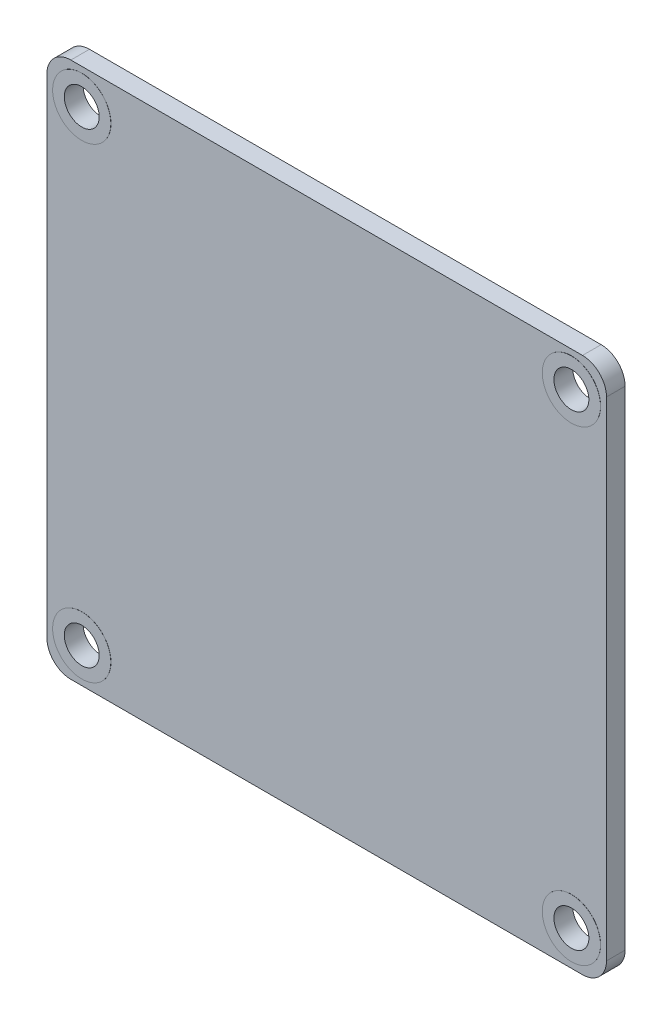
ISO-10303-21;
HEADER;
FILE_DESCRIPTION(('STEP AP214'),'2;1');
FILE_NAME('part.step','',(''),(''),'','','');
FILE_SCHEMA(('AUTOMOTIVE_DESIGN { 1 0 10303 214 1 1 1 1 }'));
ENDSEC;
DATA;
#1=APPLICATION_CONTEXT('core data for automotive mechanical design processes');
#2=APPLICATION_PROTOCOL_DEFINITION('international standard','automotive_design',2000,#1);
#3=PRODUCT_CONTEXT('',#1,'mechanical');
#4=PRODUCT('Part','Part','',(#3));
#5=PRODUCT_RELATED_PRODUCT_CATEGORY('part','',(#4));
#6=PRODUCT_DEFINITION_FORMATION('','',#4);
#7=PRODUCT_DEFINITION_CONTEXT('part definition',#1,'design');
#8=PRODUCT_DEFINITION('design','',#6,#7);
#9=PRODUCT_DEFINITION_SHAPE('','',#8);
#10=(LENGTH_UNIT() NAMED_UNIT(*) SI_UNIT(.MILLI.,.METRE.));
#11=(NAMED_UNIT(*) PLANE_ANGLE_UNIT() SI_UNIT($,.RADIAN.));
#12=(NAMED_UNIT(*) SI_UNIT($,.STERADIAN.) SOLID_ANGLE_UNIT());
#13=UNCERTAINTY_MEASURE_WITH_UNIT(LENGTH_MEASURE(1.E-05),#10,'distance_accuracy_value','');
#14=(GEOMETRIC_REPRESENTATION_CONTEXT(3) GLOBAL_UNCERTAINTY_ASSIGNED_CONTEXT((#13)) GLOBAL_UNIT_ASSIGNED_CONTEXT((#10,
#11,#12)) REPRESENTATION_CONTEXT('',''));
#15=CARTESIAN_POINT('',(0.,0.,0.));
#16=DIRECTION('',(0.,0.,1.));
#17=DIRECTION('',(1.,0.,0.));
#18=AXIS2_PLACEMENT_3D('',#15,#16,#17);
#19=CARTESIAN_POINT('',(146.604450980759,99.3487028032038,-0.01));
#20=DIRECTION('',(0.,0.,1.));
#21=DIRECTION('',(1.,0.,0.));
#22=AXIS2_PLACEMENT_3D('',#19,#20,#21);
#23=CYLINDRICAL_SURFACE('',#22,2.5);
#24=CARTESIAN_POINT('',(146.604450980759,99.3487028032038,-0.01));
#25=DIRECTION('',(0.,0.,1.));
#26=DIRECTION('',(1.,0.,0.));
#27=AXIS2_PLACEMENT_3D('',#24,#25,#26);
#28=CIRCLE('',#27,2.5);
#29=CARTESIAN_POINT('',(149.104450980759,99.3487028032038,-0.01));
#30=VERTEX_POINT('',#29);
#31=EDGE_CURVE('E11',#30,#30,#28,.T.);
#32=ORIENTED_EDGE('',*,*,#31,.T.);
#33=EDGE_LOOP('',(#32));
#34=FACE_BOUND('',#33,.T.);
#35=CARTESIAN_POINT('',(146.604450980759,99.3487028032038,1.61));
#36=DIRECTION('',(0.,0.,1.));
#37=DIRECTION('',(1.,0.,0.));
#38=AXIS2_PLACEMENT_3D('',#35,#36,#37);
#39=CIRCLE('',#38,2.5);
#40=CARTESIAN_POINT('',(149.104450980759,99.3487028032038,1.61));
#41=VERTEX_POINT('',#40);
#42=EDGE_CURVE('E50',#41,#41,#39,.T.);
#43=ORIENTED_EDGE('',*,*,#42,.F.);
#44=EDGE_LOOP('',(#43));
#45=FACE_BOUND('',#44,.T.);
#46=ADVANCED_FACE('F40',(#34,#45),#23,.T.);
#47=CARTESIAN_POINT('',(146.604450980759,99.3487028032038,-0.01));
#48=DIRECTION('',(0.,0.,1.));
#49=DIRECTION('',(1.,0.,0.));
#50=AXIS2_PLACEMENT_3D('',#47,#48,#49);
#51=PLANE('',#50);
#52=CARTESIAN_POINT('',(146.604450980759,99.3487028032038,-0.01));
#53=DIRECTION('',(0.,0.,1.));
#54=DIRECTION('',(1.,0.,0.));
#55=AXIS2_PLACEMENT_3D('',#52,#53,#54);
#56=CIRCLE('',#55,1.5);
#57=CARTESIAN_POINT('',(148.104450980759,99.3487028032038,-0.01));
#58=VERTEX_POINT('',#57);
#59=EDGE_CURVE('E46',#58,#58,#56,.T.);
#60=ORIENTED_EDGE('',*,*,#59,.T.);
#61=EDGE_LOOP('',(#60));
#62=FACE_BOUND('',#61,.T.);
#63=ORIENTED_EDGE('',*,*,#31,.F.);
#64=EDGE_LOOP('',(#63));
#65=FACE_BOUND('',#64,.T.);
#66=ADVANCED_FACE('F69',(#62,#65),#51,.F.);
#67=CARTESIAN_POINT('',(146.604450980759,99.3487028032038,-0.01));
#68=DIRECTION('',(0.,0.,1.));
#69=DIRECTION('',(1.,0.,0.));
#70=AXIS2_PLACEMENT_3D('',#67,#68,#69);
#71=CYLINDRICAL_SURFACE('',#70,1.5);
#72=ORIENTED_EDGE('',*,*,#59,.F.);
#73=EDGE_LOOP('',(#72));
#74=FACE_BOUND('',#73,.T.);
#75=CARTESIAN_POINT('',(146.604450980759,99.3487028032038,1.61));
#76=DIRECTION('',(0.,0.,1.));
#77=DIRECTION('',(1.,0.,0.));
#78=AXIS2_PLACEMENT_3D('',#75,#76,#77);
#79=CIRCLE('',#78,1.5);
#80=CARTESIAN_POINT('',(148.104450980759,99.3487028032038,1.61));
#81=VERTEX_POINT('',#80);
#82=EDGE_CURVE('E54',#81,#81,#79,.T.);
#83=ORIENTED_EDGE('',*,*,#82,.T.);
#84=EDGE_LOOP('',(#83));
#85=FACE_BOUND('',#84,.T.);
#86=ADVANCED_FACE('F60',(#74,#85),#71,.F.);
#87=CARTESIAN_POINT('',(146.604450980759,99.3487028032038,1.61));
#88=DIRECTION('',(0.,0.,1.));
#89=DIRECTION('',(1.,0.,0.));
#90=AXIS2_PLACEMENT_3D('',#87,#88,#89);
#91=PLANE('',#90);
#92=ORIENTED_EDGE('',*,*,#42,.T.);
#93=EDGE_LOOP('',(#92));
#94=FACE_BOUND('',#93,.T.);
#95=ORIENTED_EDGE('',*,*,#82,.F.);
#96=EDGE_LOOP('',(#95));
#97=FACE_BOUND('',#96,.T.);
#98=ADVANCED_FACE('F62',(#94,#97),#91,.T.);
#99=CLOSED_SHELL('',(#46,#66,#86,#98));
#100=MANIFOLD_SOLID_BREP('B2',#99);
#101=CARTESIAN_POINT('',(104.569478388759,99.3487028032038,-0.01));
#102=DIRECTION('',(0.,0.,1.));
#103=DIRECTION('',(1.,0.,0.));
#104=AXIS2_PLACEMENT_3D('',#101,#102,#103);
#105=CYLINDRICAL_SURFACE('',#104,2.5);
#106=CARTESIAN_POINT('',(104.569478388759,99.3487028032038,-0.01));
#107=DIRECTION('',(0.,0.,1.));
#108=DIRECTION('',(1.,0.,0.));
#109=AXIS2_PLACEMENT_3D('',#106,#107,#108);
#110=CIRCLE('',#109,2.5);
#111=CARTESIAN_POINT('',(107.069478388759,99.3487028032038,-0.01));
#112=VERTEX_POINT('',#111);
#113=EDGE_CURVE('E39',#112,#112,#110,.T.);
#114=ORIENTED_EDGE('',*,*,#113,.T.);
#115=EDGE_LOOP('',(#114));
#116=FACE_BOUND('',#115,.T.);
#117=CARTESIAN_POINT('',(104.569478388759,99.3487028032038,1.61));
#118=DIRECTION('',(0.,0.,1.));
#119=DIRECTION('',(1.,0.,0.));
#120=AXIS2_PLACEMENT_3D('',#117,#118,#119);
#121=CIRCLE('',#120,2.5);
#122=CARTESIAN_POINT('',(107.069478388759,99.3487028032038,1.61));
#123=VERTEX_POINT('',#122);
#124=EDGE_CURVE('E120',#123,#123,#121,.T.);
#125=ORIENTED_EDGE('',*,*,#124,.F.);
#126=EDGE_LOOP('',(#125));
#127=FACE_BOUND('',#126,.T.);
#128=ADVANCED_FACE('F110',(#116,#127),#105,.T.);
#129=CARTESIAN_POINT('',(104.569478388759,99.3487028032038,-0.01));
#130=DIRECTION('',(0.,0.,1.));
#131=DIRECTION('',(1.,0.,0.));
#132=AXIS2_PLACEMENT_3D('',#129,#130,#131);
#133=PLANE('',#132);
#134=CARTESIAN_POINT('',(104.569478388759,99.3487028032038,-0.01));
#135=DIRECTION('',(0.,0.,1.));
#136=DIRECTION('',(1.,0.,0.));
#137=AXIS2_PLACEMENT_3D('',#134,#135,#136);
#138=CIRCLE('',#137,1.5);
#139=CARTESIAN_POINT('',(106.069478388759,99.3487028032038,-0.01));
#140=VERTEX_POINT('',#139);
#141=EDGE_CURVE('E116',#140,#140,#138,.T.);
#142=ORIENTED_EDGE('',*,*,#141,.T.);
#143=EDGE_LOOP('',(#142));
#144=FACE_BOUND('',#143,.T.);
#145=ORIENTED_EDGE('',*,*,#113,.F.);
#146=EDGE_LOOP('',(#145));
#147=FACE_BOUND('',#146,.T.);
#148=ADVANCED_FACE('F139',(#144,#147),#133,.F.);
#149=CARTESIAN_POINT('',(104.569478388759,99.3487028032038,-0.01));
#150=DIRECTION('',(0.,0.,1.));
#151=DIRECTION('',(1.,0.,0.));
#152=AXIS2_PLACEMENT_3D('',#149,#150,#151);
#153=CYLINDRICAL_SURFACE('',#152,1.5);
#154=ORIENTED_EDGE('',*,*,#141,.F.);
#155=EDGE_LOOP('',(#154));
#156=FACE_BOUND('',#155,.T.);
#157=CARTESIAN_POINT('',(104.569478388759,99.3487028032038,1.61));
#158=DIRECTION('',(0.,0.,1.));
#159=DIRECTION('',(1.,0.,0.));
#160=AXIS2_PLACEMENT_3D('',#157,#158,#159);
#161=CIRCLE('',#160,1.5);
#162=CARTESIAN_POINT('',(106.069478388759,99.3487028032038,1.61));
#163=VERTEX_POINT('',#162);
#164=EDGE_CURVE('E124',#163,#163,#161,.T.);
#165=ORIENTED_EDGE('',*,*,#164,.T.);
#166=EDGE_LOOP('',(#165));
#167=FACE_BOUND('',#166,.T.);
#168=ADVANCED_FACE('F130',(#156,#167),#153,.F.);
#169=CARTESIAN_POINT('',(104.569478388759,99.3487028032038,1.61));
#170=DIRECTION('',(0.,0.,1.));
#171=DIRECTION('',(1.,0.,0.));
#172=AXIS2_PLACEMENT_3D('',#169,#170,#171);
#173=PLANE('',#172);
#174=ORIENTED_EDGE('',*,*,#124,.T.);
#175=EDGE_LOOP('',(#174));
#176=FACE_BOUND('',#175,.T.);
#177=ORIENTED_EDGE('',*,*,#164,.F.);
#178=EDGE_LOOP('',(#177));
#179=FACE_BOUND('',#178,.T.);
#180=ADVANCED_FACE('F132',(#176,#179),#173,.T.);
#181=CLOSED_SHELL('',(#128,#148,#168,#180));
#182=MANIFOLD_SOLID_BREP('B6',#181);
#183=CARTESIAN_POINT('',(104.569478388759,139.38728612082,-0.01));
#184=DIRECTION('',(0.,0.,1.));
#185=DIRECTION('',(1.,0.,0.));
#186=AXIS2_PLACEMENT_3D('',#183,#184,#185);
#187=CYLINDRICAL_SURFACE('',#186,2.5);
#188=CARTESIAN_POINT('',(104.569478388759,139.38728612082,-0.01));
#189=DIRECTION('',(0.,0.,1.));
#190=DIRECTION('',(1.,0.,0.));
#191=AXIS2_PLACEMENT_3D('',#188,#189,#190);
#192=CIRCLE('',#191,2.5);
#193=CARTESIAN_POINT('',(107.069478388759,139.38728612082,-0.01));
#194=VERTEX_POINT('',#193);
#195=EDGE_CURVE('E109',#194,#194,#192,.T.);
#196=ORIENTED_EDGE('',*,*,#195,.T.);
#197=EDGE_LOOP('',(#196));
#198=FACE_BOUND('',#197,.T.);
#199=CARTESIAN_POINT('',(104.569478388759,139.38728612082,1.61));
#200=DIRECTION('',(0.,0.,1.));
#201=DIRECTION('',(1.,0.,0.));
#202=AXIS2_PLACEMENT_3D('',#199,#200,#201);
#203=CIRCLE('',#202,2.5);
#204=CARTESIAN_POINT('',(107.069478388759,139.38728612082,1.61));
#205=VERTEX_POINT('',#204);
#206=EDGE_CURVE('E190',#205,#205,#203,.T.);
#207=ORIENTED_EDGE('',*,*,#206,.F.);
#208=EDGE_LOOP('',(#207));
#209=FACE_BOUND('',#208,.T.);
#210=ADVANCED_FACE('F180',(#198,#209),#187,.T.);
#211=CARTESIAN_POINT('',(104.569478388759,139.38728612082,-0.01));
#212=DIRECTION('',(0.,0.,1.));
#213=DIRECTION('',(1.,0.,0.));
#214=AXIS2_PLACEMENT_3D('',#211,#212,#213);
#215=PLANE('',#214);
#216=CARTESIAN_POINT('',(104.569478388759,139.38728612082,-0.01));
#217=DIRECTION('',(0.,0.,1.));
#218=DIRECTION('',(1.,0.,0.));
#219=AXIS2_PLACEMENT_3D('',#216,#217,#218);
#220=CIRCLE('',#219,1.5);
#221=CARTESIAN_POINT('',(106.069478388759,139.38728612082,-0.01));
#222=VERTEX_POINT('',#221);
#223=EDGE_CURVE('E186',#222,#222,#220,.T.);
#224=ORIENTED_EDGE('',*,*,#223,.T.);
#225=EDGE_LOOP('',(#224));
#226=FACE_BOUND('',#225,.T.);
#227=ORIENTED_EDGE('',*,*,#195,.F.);
#228=EDGE_LOOP('',(#227));
#229=FACE_BOUND('',#228,.T.);
#230=ADVANCED_FACE('F209',(#226,#229),#215,.F.);
#231=CARTESIAN_POINT('',(104.569478388759,139.38728612082,-0.01));
#232=DIRECTION('',(0.,0.,1.));
#233=DIRECTION('',(1.,0.,0.));
#234=AXIS2_PLACEMENT_3D('',#231,#232,#233);
#235=CYLINDRICAL_SURFACE('',#234,1.5);
#236=ORIENTED_EDGE('',*,*,#223,.F.);
#237=EDGE_LOOP('',(#236));
#238=FACE_BOUND('',#237,.T.);
#239=CARTESIAN_POINT('',(104.569478388759,139.38728612082,1.61));
#240=DIRECTION('',(0.,0.,1.));
#241=DIRECTION('',(1.,0.,0.));
#242=AXIS2_PLACEMENT_3D('',#239,#240,#241);
#243=CIRCLE('',#242,1.5);
#244=CARTESIAN_POINT('',(106.069478388759,139.38728612082,1.61));
#245=VERTEX_POINT('',#244);
#246=EDGE_CURVE('E194',#245,#245,#243,.T.);
#247=ORIENTED_EDGE('',*,*,#246,.T.);
#248=EDGE_LOOP('',(#247));
#249=FACE_BOUND('',#248,.T.);
#250=ADVANCED_FACE('F200',(#238,#249),#235,.F.);
#251=CARTESIAN_POINT('',(104.569478388759,139.38728612082,1.61));
#252=DIRECTION('',(0.,0.,1.));
#253=DIRECTION('',(1.,0.,0.));
#254=AXIS2_PLACEMENT_3D('',#251,#252,#253);
#255=PLANE('',#254);
#256=ORIENTED_EDGE('',*,*,#206,.T.);
#257=EDGE_LOOP('',(#256));
#258=FACE_BOUND('',#257,.T.);
#259=ORIENTED_EDGE('',*,*,#246,.F.);
#260=EDGE_LOOP('',(#259));
#261=FACE_BOUND('',#260,.T.);
#262=ADVANCED_FACE('F202',(#258,#261),#255,.T.);
#263=CLOSED_SHELL('',(#210,#230,#250,#262));
#264=MANIFOLD_SOLID_BREP('B34',#263);
#265=CARTESIAN_POINT('',(146.604450980759,139.38728612082,-0.01));
#266=DIRECTION('',(0.,0.,1.));
#267=DIRECTION('',(1.,0.,0.));
#268=AXIS2_PLACEMENT_3D('',#265,#266,#267);
#269=CYLINDRICAL_SURFACE('',#268,2.5);
#270=CARTESIAN_POINT('',(146.604450980759,139.38728612082,-0.01));
#271=DIRECTION('',(0.,0.,1.));
#272=DIRECTION('',(1.,0.,0.));
#273=AXIS2_PLACEMENT_3D('',#270,#271,#272);
#274=CIRCLE('',#273,2.5);
#275=CARTESIAN_POINT('',(149.104450980759,139.38728612082,-0.01));
#276=VERTEX_POINT('',#275);
#277=EDGE_CURVE('E179',#276,#276,#274,.T.);
#278=ORIENTED_EDGE('',*,*,#277,.T.);
#279=EDGE_LOOP('',(#278));
#280=FACE_BOUND('',#279,.T.);
#281=CARTESIAN_POINT('',(146.604450980759,139.38728612082,1.61));
#282=DIRECTION('',(0.,0.,1.));
#283=DIRECTION('',(1.,0.,0.));
#284=AXIS2_PLACEMENT_3D('',#281,#282,#283);
#285=CIRCLE('',#284,2.5);
#286=CARTESIAN_POINT('',(149.104450980759,139.38728612082,1.61));
#287=VERTEX_POINT('',#286);
#288=EDGE_CURVE('E261',#287,#287,#285,.T.);
#289=ORIENTED_EDGE('',*,*,#288,.F.);
#290=EDGE_LOOP('',(#289));
#291=FACE_BOUND('',#290,.T.);
#292=ADVANCED_FACE('F251',(#280,#291),#269,.T.);
#293=CARTESIAN_POINT('',(146.604450980759,139.38728612082,-0.01));
#294=DIRECTION('',(0.,0.,1.));
#295=DIRECTION('',(1.,0.,0.));
#296=AXIS2_PLACEMENT_3D('',#293,#294,#295);
#297=PLANE('',#296);
#298=CARTESIAN_POINT('',(146.604450980759,139.38728612082,-0.01));
#299=DIRECTION('',(0.,0.,1.));
#300=DIRECTION('',(1.,0.,0.));
#301=AXIS2_PLACEMENT_3D('',#298,#299,#300);
#302=CIRCLE('',#301,1.5);
#303=CARTESIAN_POINT('',(148.104450980759,139.38728612082,-0.01));
#304=VERTEX_POINT('',#303);
#305=EDGE_CURVE('E257',#304,#304,#302,.T.);
#306=ORIENTED_EDGE('',*,*,#305,.T.);
#307=EDGE_LOOP('',(#306));
#308=FACE_BOUND('',#307,.T.);
#309=ORIENTED_EDGE('',*,*,#277,.F.);
#310=EDGE_LOOP('',(#309));
#311=FACE_BOUND('',#310,.T.);
#312=ADVANCED_FACE('F280',(#308,#311),#297,.F.);
#313=CARTESIAN_POINT('',(146.604450980759,139.38728612082,-0.01));
#314=DIRECTION('',(0.,0.,1.));
#315=DIRECTION('',(1.,0.,0.));
#316=AXIS2_PLACEMENT_3D('',#313,#314,#315);
#317=CYLINDRICAL_SURFACE('',#316,1.5);
#318=ORIENTED_EDGE('',*,*,#305,.F.);
#319=EDGE_LOOP('',(#318));
#320=FACE_BOUND('',#319,.T.);
#321=CARTESIAN_POINT('',(146.604450980759,139.38728612082,1.61));
#322=DIRECTION('',(0.,0.,1.));
#323=DIRECTION('',(1.,0.,0.));
#324=AXIS2_PLACEMENT_3D('',#321,#322,#323);
#325=CIRCLE('',#324,1.5);
#326=CARTESIAN_POINT('',(148.104450980759,139.38728612082,1.61));
#327=VERTEX_POINT('',#326);
#328=EDGE_CURVE('E265',#327,#327,#325,.T.);
#329=ORIENTED_EDGE('',*,*,#328,.T.);
#330=EDGE_LOOP('',(#329));
#331=FACE_BOUND('',#330,.T.);
#332=ADVANCED_FACE('F271',(#320,#331),#317,.F.);
#333=CARTESIAN_POINT('',(146.604450980759,139.38728612082,1.61));
#334=DIRECTION('',(0.,0.,1.));
#335=DIRECTION('',(1.,0.,0.));
#336=AXIS2_PLACEMENT_3D('',#333,#334,#335);
#337=PLANE('',#336);
#338=ORIENTED_EDGE('',*,*,#288,.T.);
#339=EDGE_LOOP('',(#338));
#340=FACE_BOUND('',#339,.T.);
#341=ORIENTED_EDGE('',*,*,#328,.F.);
#342=EDGE_LOOP('',(#341));
#343=FACE_BOUND('',#342,.T.);
#344=ADVANCED_FACE('F273',(#340,#343),#337,.T.);
#345=CLOSED_SHELL('',(#292,#312,#332,#344));
#346=MANIFOLD_SOLID_BREP('B104',#345);
#347=CARTESIAN_POINT('',(103.626682713888,140.330081795691,1.6));
#348=DIRECTION('',(0.,0.,-1.));
#349=DIRECTION('',(-1.,0.,0.));
#350=AXIS2_PLACEMENT_3D('',#347,#348,#349);
#351=PLANE('',#350);
#352=CARTESIAN_POINT('',(103.626682713888,140.330081795691,1.6));
#353=DIRECTION('',(0.,0.,1.));
#354=DIRECTION('',(-1.,0.,0.));
#355=AXIS2_PLACEMENT_3D('',#352,#353,#354);
#356=CIRCLE('',#355,2.05977480797048);
#357=CARTESIAN_POINT('',(103.626682713888,142.389856603662,1.6));
#358=VERTEX_POINT('',#357);
#359=CARTESIAN_POINT('',(101.566907905917,140.330081795691,1.6));
#360=VERTEX_POINT('',#359);
#361=EDGE_CURVE('E425',#358,#360,#356,.T.);
#362=ORIENTED_EDGE('',*,*,#361,.T.);
#363=DIRECTION('',(0.,-1.,0.));
#364=VECTOR('',#363,1.);
#365=CARTESIAN_POINT('',(101.566907905917,140.330081795691,1.6));
#366=LINE('',#365,#364);
#367=CARTESIAN_POINT('',(101.566907905917,98.4059071283329,1.6));
#368=VERTEX_POINT('',#367);
#369=EDGE_CURVE('E373',#360,#368,#366,.T.);
#370=ORIENTED_EDGE('',*,*,#369,.T.);
#371=CARTESIAN_POINT('',(103.626682713888,98.4059071283329,1.6));
#372=DIRECTION('',(0.,0.,1.));
#373=DIRECTION('',(-1.,0.,0.));
#374=AXIS2_PLACEMENT_3D('',#371,#372,#373);
#375=CIRCLE('',#374,2.05977480797049);
#376=CARTESIAN_POINT('',(103.626682713888,96.3461323203624,1.6));
#377=VERTEX_POINT('',#376);
#378=EDGE_CURVE('E440',#368,#377,#375,.T.);
#379=ORIENTED_EDGE('',*,*,#378,.T.);
#380=DIRECTION('',(1.,0.,0.));
#381=VECTOR('',#380,1.);
#382=CARTESIAN_POINT('',(103.626682713888,96.3461323203624,1.6));
#383=LINE('',#382,#381);
#384=CARTESIAN_POINT('',(147.547246655631,96.3461323203624,1.6));
#385=VERTEX_POINT('',#384);
#386=EDGE_CURVE('E453',#377,#385,#383,.T.);
#387=ORIENTED_EDGE('',*,*,#386,.T.);
#388=CARTESIAN_POINT('',(147.547246655631,98.4059071283329,1.6));
#389=DIRECTION('',(0.,0.,1.));
#390=DIRECTION('',(-1.,0.,0.));
#391=AXIS2_PLACEMENT_3D('',#388,#389,#390);
#392=CIRCLE('',#391,2.05977480797048);
#393=CARTESIAN_POINT('',(149.607021463601,98.4059071283329,1.6));
#394=VERTEX_POINT('',#393);
#395=EDGE_CURVE('E392',#385,#394,#392,.T.);
#396=ORIENTED_EDGE('',*,*,#395,.T.);
#397=DIRECTION('',(0.,1.,0.));
#398=VECTOR('',#397,1.);
#399=CARTESIAN_POINT('',(149.607021463601,98.4059071283329,1.6));
#400=LINE('',#399,#398);
#401=CARTESIAN_POINT('',(149.607021463601,140.330081795691,1.6));
#402=VERTEX_POINT('',#401);
#403=EDGE_CURVE('E386',#394,#402,#400,.T.);
#404=ORIENTED_EDGE('',*,*,#403,.T.);
#405=CARTESIAN_POINT('',(147.547246655631,140.330081795691,1.6));
#406=DIRECTION('',(0.,0.,1.));
#407=DIRECTION('',(-1.,0.,0.));
#408=AXIS2_PLACEMENT_3D('',#405,#406,#407);
#409=CIRCLE('',#408,2.05977480797052);
#410=CARTESIAN_POINT('',(147.547246655631,142.389856603662,1.6));
#411=VERTEX_POINT('',#410);
#412=EDGE_CURVE('E390',#402,#411,#409,.T.);
#413=ORIENTED_EDGE('',*,*,#412,.T.);
#414=DIRECTION('',(-1.,0.,0.));
#415=VECTOR('',#414,1.);
#416=CARTESIAN_POINT('',(147.547246655631,142.389856603662,1.6));
#417=LINE('',#416,#415);
#418=EDGE_CURVE('E330',#411,#358,#417,.T.);
#419=ORIENTED_EDGE('',*,*,#418,.T.);
#420=EDGE_LOOP('',(#362,#370,#379,#387,#396,#404,#413,#419));
#421=FACE_BOUND('',#420,.T.);
#422=CARTESIAN_POINT('',(146.604450980759,139.38728612082,1.6));
#423=DIRECTION('',(0.,0.,1.));
#424=DIRECTION('',(1.,0.,0.));
#425=AXIS2_PLACEMENT_3D('',#422,#423,#424);
#426=CIRCLE('',#425,2.5);
#427=CARTESIAN_POINT('',(149.104450980759,139.38728612082,1.6));
#428=VERTEX_POINT('',#427);
#429=EDGE_CURVE('E414',#428,#428,#426,.T.);
#430=ORIENTED_EDGE('',*,*,#429,.F.);
#431=EDGE_LOOP('',(#430));
#432=FACE_BOUND('',#431,.T.);
#433=CARTESIAN_POINT('',(104.569478388759,139.38728612082,1.6));
#434=DIRECTION('',(0.,0.,1.));
#435=DIRECTION('',(1.,0.,0.));
#436=AXIS2_PLACEMENT_3D('',#433,#434,#435);
#437=CIRCLE('',#436,2.5);
#438=CARTESIAN_POINT('',(107.069478388759,139.38728612082,1.6));
#439=VERTEX_POINT('',#438);
#440=EDGE_CURVE('E462',#439,#439,#437,.T.);
#441=ORIENTED_EDGE('',*,*,#440,.F.);
#442=EDGE_LOOP('',(#441));
#443=FACE_BOUND('',#442,.T.);
#444=CARTESIAN_POINT('',(104.569478388759,99.3487028032038,1.6));
#445=DIRECTION('',(0.,0.,1.));
#446=DIRECTION('',(1.,0.,0.));
#447=AXIS2_PLACEMENT_3D('',#444,#445,#446);
#448=CIRCLE('',#447,2.5);
#449=CARTESIAN_POINT('',(107.069478388759,99.3487028032038,1.6));
#450=VERTEX_POINT('',#449);
#451=EDGE_CURVE('E468',#450,#450,#448,.T.);
#452=ORIENTED_EDGE('',*,*,#451,.F.);
#453=EDGE_LOOP('',(#452));
#454=FACE_BOUND('',#453,.T.);
#455=CARTESIAN_POINT('',(146.604450980759,99.3487028032038,1.6));
#456=DIRECTION('',(0.,0.,1.));
#457=DIRECTION('',(1.,0.,0.));
#458=AXIS2_PLACEMENT_3D('',#455,#456,#457);
#459=CIRCLE('',#458,2.5);
#460=CARTESIAN_POINT('',(149.104450980759,99.3487028032038,1.6));
#461=VERTEX_POINT('',#460);
#462=EDGE_CURVE('E474',#461,#461,#459,.T.);
#463=ORIENTED_EDGE('',*,*,#462,.F.);
#464=EDGE_LOOP('',(#463));
#465=FACE_BOUND('',#464,.T.);
#466=ADVANCED_FACE('F313',(#421,#432,#443,#454,#465),#351,.F.);
#467=CARTESIAN_POINT('',(103.626682713888,140.330081795691,0.));
#468=DIRECTION('',(0.,0.,-1.));
#469=DIRECTION('',(-1.,0.,0.));
#470=AXIS2_PLACEMENT_3D('',#467,#468,#469);
#471=PLANE('',#470);
#472=CARTESIAN_POINT('',(104.569478388759,99.3487028032038,0.));
#473=DIRECTION('',(0.,0.,1.));
#474=DIRECTION('',(1.,0.,0.));
#475=AXIS2_PLACEMENT_3D('',#472,#473,#474);
#476=CIRCLE('',#475,2.5);
#477=CARTESIAN_POINT('',(107.069478388759,99.3487028032038,0.));
#478=VERTEX_POINT('',#477);
#479=EDGE_CURVE('E471',#478,#478,#476,.T.);
#480=ORIENTED_EDGE('',*,*,#479,.T.);
#481=EDGE_LOOP('',(#480));
#482=FACE_BOUND('',#481,.T.);
#483=CARTESIAN_POINT('',(146.604450980759,139.38728612082,0.));
#484=DIRECTION('',(0.,0.,1.));
#485=DIRECTION('',(1.,0.,0.));
#486=AXIS2_PLACEMENT_3D('',#483,#484,#485);
#487=CIRCLE('',#486,2.5);
#488=CARTESIAN_POINT('',(149.104450980759,139.38728612082,0.));
#489=VERTEX_POINT('',#488);
#490=EDGE_CURVE('E459',#489,#489,#487,.T.);
#491=ORIENTED_EDGE('',*,*,#490,.T.);
#492=EDGE_LOOP('',(#491));
#493=FACE_BOUND('',#492,.T.);
#494=CARTESIAN_POINT('',(103.626682713888,140.330081795691,0.));
#495=DIRECTION('',(0.,0.,1.));
#496=DIRECTION('',(-1.,0.,0.));
#497=AXIS2_PLACEMENT_3D('',#494,#495,#496);
#498=CIRCLE('',#497,2.05977480797048);
#499=CARTESIAN_POINT('',(103.626682713888,142.389856603662,0.));
#500=VERTEX_POINT('',#499);
#501=CARTESIAN_POINT('',(101.566907905917,140.330081795691,0.));
#502=VERTEX_POINT('',#501);
#503=EDGE_CURVE('E410',#500,#502,#498,.T.);
#504=ORIENTED_EDGE('',*,*,#503,.F.);
#505=DIRECTION('',(-1.,0.,0.));
#506=VECTOR('',#505,1.);
#507=CARTESIAN_POINT('',(147.547246655631,142.389856603662,0.));
#508=LINE('',#507,#506);
#509=CARTESIAN_POINT('',(147.547246655631,142.389856603662,0.));
#510=VERTEX_POINT('',#509);
#511=EDGE_CURVE('E365',#510,#500,#508,.T.);
#512=ORIENTED_EDGE('',*,*,#511,.F.);
#513=CARTESIAN_POINT('',(147.547246655631,140.330081795691,0.));
#514=DIRECTION('',(0.,0.,1.));
#515=DIRECTION('',(-1.,0.,0.));
#516=AXIS2_PLACEMENT_3D('',#513,#514,#515);
#517=CIRCLE('',#516,2.05977480797052);
#518=CARTESIAN_POINT('',(149.607021463601,140.330081795691,0.));
#519=VERTEX_POINT('',#518);
#520=EDGE_CURVE('E359',#519,#510,#517,.T.);
#521=ORIENTED_EDGE('',*,*,#520,.F.);
#522=DIRECTION('',(0.,1.,0.));
#523=VECTOR('',#522,1.);
#524=CARTESIAN_POINT('',(149.607021463601,98.4059071283329,0.));
#525=LINE('',#524,#523);
#526=CARTESIAN_POINT('',(149.607021463601,98.4059071283329,0.));
#527=VERTEX_POINT('',#526);
#528=EDGE_CURVE('E400',#527,#519,#525,.T.);
#529=ORIENTED_EDGE('',*,*,#528,.F.);
#530=CARTESIAN_POINT('',(147.547246655631,98.4059071283329,0.));
#531=DIRECTION('',(0.,0.,1.));
#532=DIRECTION('',(-1.,0.,0.));
#533=AXIS2_PLACEMENT_3D('',#530,#531,#532);
#534=CIRCLE('',#533,2.05977480797048);
#535=CARTESIAN_POINT('',(147.547246655631,96.3461323203624,0.));
#536=VERTEX_POINT('',#535);
#537=EDGE_CURVE('E420',#536,#527,#534,.T.);
#538=ORIENTED_EDGE('',*,*,#537,.F.);
#539=DIRECTION('',(1.,0.,0.));
#540=VECTOR('',#539,1.);
#541=CARTESIAN_POINT('',(103.626682713888,96.3461323203624,0.));
#542=LINE('',#541,#540);
#543=CARTESIAN_POINT('',(103.626682713888,96.3461323203624,0.));
#544=VERTEX_POINT('',#543);
#545=EDGE_CURVE('E418',#544,#536,#542,.T.);
#546=ORIENTED_EDGE('',*,*,#545,.F.);
#547=CARTESIAN_POINT('',(103.626682713888,98.4059071283329,0.));
#548=DIRECTION('',(0.,0.,1.));
#549=DIRECTION('',(-1.,0.,0.));
#550=AXIS2_PLACEMENT_3D('',#547,#548,#549);
#551=CIRCLE('',#550,2.05977480797049);
#552=CARTESIAN_POINT('',(101.566907905917,98.4059071283329,0.));
#553=VERTEX_POINT('',#552);
#554=EDGE_CURVE('E416',#553,#544,#551,.T.);
#555=ORIENTED_EDGE('',*,*,#554,.F.);
#556=DIRECTION('',(0.,-1.,0.));
#557=VECTOR('',#556,1.);
#558=CARTESIAN_POINT('',(101.566907905917,140.330081795691,0.));
#559=LINE('',#558,#557);
#560=EDGE_CURVE('E413',#502,#553,#559,.T.);
#561=ORIENTED_EDGE('',*,*,#560,.F.);
#562=EDGE_LOOP('',(#504,#512,#521,#529,#538,#546,#555,#561));
#563=FACE_BOUND('',#562,.T.);
#564=CARTESIAN_POINT('',(104.569478388759,139.38728612082,0.));
#565=DIRECTION('',(0.,0.,1.));
#566=DIRECTION('',(1.,0.,0.));
#567=AXIS2_PLACEMENT_3D('',#564,#565,#566);
#568=CIRCLE('',#567,2.5);
#569=CARTESIAN_POINT('',(107.069478388759,139.38728612082,0.));
#570=VERTEX_POINT('',#569);
#571=EDGE_CURVE('E465',#570,#570,#568,.T.);
#572=ORIENTED_EDGE('',*,*,#571,.T.);
#573=EDGE_LOOP('',(#572));
#574=FACE_BOUND('',#573,.T.);
#575=CARTESIAN_POINT('',(146.604450980759,99.3487028032038,0.));
#576=DIRECTION('',(0.,0.,1.));
#577=DIRECTION('',(1.,0.,0.));
#578=AXIS2_PLACEMENT_3D('',#575,#576,#577);
#579=CIRCLE('',#578,2.5);
#580=CARTESIAN_POINT('',(149.104450980759,99.3487028032038,0.));
#581=VERTEX_POINT('',#580);
#582=EDGE_CURVE('E477',#581,#581,#579,.T.);
#583=ORIENTED_EDGE('',*,*,#582,.T.);
#584=EDGE_LOOP('',(#583));
#585=FACE_BOUND('',#584,.T.);
#586=ADVANCED_FACE('F444',(#482,#493,#563,#574,#585),#471,.T.);
#587=CARTESIAN_POINT('',(103.626682713888,140.330081795691,1.6));
#588=DIRECTION('',(0.,0.,-1.));
#589=DIRECTION('',(-1.,0.,0.));
#590=AXIS2_PLACEMENT_3D('',#587,#588,#589);
#591=CYLINDRICAL_SURFACE('',#590,2.05977480797048);
#592=ORIENTED_EDGE('',*,*,#503,.T.);
#593=DIRECTION('',(0.,0.,-1.));
#594=VECTOR('',#593,1.);
#595=CARTESIAN_POINT('',(101.566907905917,140.330081795691,1.6));
#596=LINE('',#595,#594);
#597=EDGE_CURVE('E249',#360,#502,#596,.T.);
#598=ORIENTED_EDGE('',*,*,#597,.F.);
#599=ORIENTED_EDGE('',*,*,#361,.F.);
#600=DIRECTION('',(0.,0.,-1.));
#601=VECTOR('',#600,1.);
#602=CARTESIAN_POINT('',(103.626682713888,142.389856603662,1.6));
#603=LINE('',#602,#601);
#604=EDGE_CURVE('E406',#358,#500,#603,.T.);
#605=ORIENTED_EDGE('',*,*,#604,.T.);
#606=EDGE_LOOP('',(#592,#598,#599,#605));
#607=FACE_BOUND('',#606,.T.);
#608=ADVANCED_FACE('F315',(#607),#591,.T.);
#609=CARTESIAN_POINT('',(101.566907905917,140.330081795691,1.6));
#610=DIRECTION('',(1.,0.,0.));
#611=DIRECTION('',(0.,0.,-1.));
#612=AXIS2_PLACEMENT_3D('',#609,#610,#611);
#613=PLANE('',#612);
#614=ORIENTED_EDGE('',*,*,#560,.T.);
#615=DIRECTION('',(0.,0.,-1.));
#616=VECTOR('',#615,1.);
#617=CARTESIAN_POINT('',(101.566907905917,98.4059071283329,1.6));
#618=LINE('',#617,#616);
#619=EDGE_CURVE('E322',#368,#553,#618,.T.);
#620=ORIENTED_EDGE('',*,*,#619,.F.);
#621=ORIENTED_EDGE('',*,*,#369,.F.);
#622=ORIENTED_EDGE('',*,*,#597,.T.);
#623=EDGE_LOOP('',(#614,#620,#621,#622));
#624=FACE_BOUND('',#623,.T.);
#625=ADVANCED_FACE('F509',(#624),#613,.F.);
#626=CARTESIAN_POINT('',(103.626682713888,98.4059071283329,1.6));
#627=DIRECTION('',(0.,0.,-1.));
#628=DIRECTION('',(-1.,0.,0.));
#629=AXIS2_PLACEMENT_3D('',#626,#627,#628);
#630=CYLINDRICAL_SURFACE('',#629,2.05977480797049);
#631=ORIENTED_EDGE('',*,*,#554,.T.);
#632=DIRECTION('',(0.,0.,-1.));
#633=VECTOR('',#632,1.);
#634=CARTESIAN_POINT('',(103.626682713888,96.3461323203624,1.6));
#635=LINE('',#634,#633);
#636=EDGE_CURVE('E432',#377,#544,#635,.T.);
#637=ORIENTED_EDGE('',*,*,#636,.F.);
#638=ORIENTED_EDGE('',*,*,#378,.F.);
#639=ORIENTED_EDGE('',*,*,#619,.T.);
#640=EDGE_LOOP('',(#631,#637,#638,#639));
#641=FACE_BOUND('',#640,.T.);
#642=ADVANCED_FACE('F438',(#641),#630,.T.);
#643=CARTESIAN_POINT('',(103.626682713888,96.3461323203624,1.6));
#644=DIRECTION('',(0.,1.,0.));
#645=DIRECTION('',(0.,0.,1.));
#646=AXIS2_PLACEMENT_3D('',#643,#644,#645);
#647=PLANE('',#646);
#648=ORIENTED_EDGE('',*,*,#545,.T.);
#649=DIRECTION('',(0.,0.,-1.));
#650=VECTOR('',#649,1.);
#651=CARTESIAN_POINT('',(147.547246655631,96.3461323203624,1.6));
#652=LINE('',#651,#650);
#653=EDGE_CURVE('E429',#385,#536,#652,.T.);
#654=ORIENTED_EDGE('',*,*,#653,.F.);
#655=ORIENTED_EDGE('',*,*,#386,.F.);
#656=ORIENTED_EDGE('',*,*,#636,.T.);
#657=EDGE_LOOP('',(#648,#654,#655,#656));
#658=FACE_BOUND('',#657,.T.);
#659=ADVANCED_FACE('F449',(#658),#647,.F.);
#660=CARTESIAN_POINT('',(147.547246655631,98.4059071283329,1.6));
#661=DIRECTION('',(0.,0.,-1.));
#662=DIRECTION('',(-1.,0.,0.));
#663=AXIS2_PLACEMENT_3D('',#660,#661,#662);
#664=CYLINDRICAL_SURFACE('',#663,2.05977480797048);
#665=ORIENTED_EDGE('',*,*,#537,.T.);
#666=DIRECTION('',(0.,0.,-1.));
#667=VECTOR('',#666,1.);
#668=CARTESIAN_POINT('',(149.607021463601,98.4059071283329,1.6));
#669=LINE('',#668,#667);
#670=EDGE_CURVE('E401',#394,#527,#669,.T.);
#671=ORIENTED_EDGE('',*,*,#670,.F.);
#672=ORIENTED_EDGE('',*,*,#395,.F.);
#673=ORIENTED_EDGE('',*,*,#653,.T.);
#674=EDGE_LOOP('',(#665,#671,#672,#673));
#675=FACE_BOUND('',#674,.T.);
#676=ADVANCED_FACE('F452',(#675),#664,.T.);
#677=CARTESIAN_POINT('',(149.607021463601,98.4059071283329,1.6));
#678=DIRECTION('',(-1.,0.,0.));
#679=DIRECTION('',(0.,0.,1.));
#680=AXIS2_PLACEMENT_3D('',#677,#678,#679);
#681=PLANE('',#680);
#682=ORIENTED_EDGE('',*,*,#528,.T.);
#683=DIRECTION('',(0.,0.,-1.));
#684=VECTOR('',#683,1.);
#685=CARTESIAN_POINT('',(149.607021463601,140.330081795691,1.6));
#686=LINE('',#685,#684);
#687=EDGE_CURVE('E397',#402,#519,#686,.T.);
#688=ORIENTED_EDGE('',*,*,#687,.F.);
#689=ORIENTED_EDGE('',*,*,#403,.F.);
#690=ORIENTED_EDGE('',*,*,#670,.T.);
#691=EDGE_LOOP('',(#682,#688,#689,#690));
#692=FACE_BOUND('',#691,.T.);
#693=ADVANCED_FACE('F398',(#692),#681,.F.);
#694=CARTESIAN_POINT('',(147.547246655631,140.330081795691,1.6));
#695=DIRECTION('',(0.,0.,-1.));
#696=DIRECTION('',(-1.,0.,0.));
#697=AXIS2_PLACEMENT_3D('',#694,#695,#696);
#698=CYLINDRICAL_SURFACE('',#697,2.05977480797052);
#699=ORIENTED_EDGE('',*,*,#520,.T.);
#700=DIRECTION('',(0.,0.,-1.));
#701=VECTOR('',#700,1.);
#702=CARTESIAN_POINT('',(147.547246655631,142.389856603662,1.6));
#703=LINE('',#702,#701);
#704=EDGE_CURVE('E402',#411,#510,#703,.T.);
#705=ORIENTED_EDGE('',*,*,#704,.F.);
#706=ORIENTED_EDGE('',*,*,#412,.F.);
#707=ORIENTED_EDGE('',*,*,#687,.T.);
#708=EDGE_LOOP('',(#699,#705,#706,#707));
#709=FACE_BOUND('',#708,.T.);
#710=ADVANCED_FACE('F404',(#709),#698,.T.);
#711=CARTESIAN_POINT('',(147.547246655631,142.389856603662,1.6));
#712=DIRECTION('',(0.,-1.,0.));
#713=DIRECTION('',(0.,0.,-1.));
#714=AXIS2_PLACEMENT_3D('',#711,#712,#713);
#715=PLANE('',#714);
#716=ORIENTED_EDGE('',*,*,#511,.T.);
#717=ORIENTED_EDGE('',*,*,#604,.F.);
#718=ORIENTED_EDGE('',*,*,#418,.F.);
#719=ORIENTED_EDGE('',*,*,#704,.T.);
#720=EDGE_LOOP('',(#716,#717,#718,#719));
#721=FACE_BOUND('',#720,.T.);
#722=ADVANCED_FACE('F497',(#721),#715,.F.);
#723=CARTESIAN_POINT('',(146.604450980759,139.38728612082,1.6));
#724=DIRECTION('',(0.,0.,-1.));
#725=DIRECTION('',(-1.,0.,0.));
#726=AXIS2_PLACEMENT_3D('',#723,#724,#725);
#727=CYLINDRICAL_SURFACE('',#726,2.5);
#728=ORIENTED_EDGE('',*,*,#429,.T.);
#729=EDGE_LOOP('',(#728));
#730=FACE_BOUND('',#729,.T.);
#731=ORIENTED_EDGE('',*,*,#490,.F.);
#732=EDGE_LOOP('',(#731));
#733=FACE_BOUND('',#732,.T.);
#734=ADVANCED_FACE('F494',(#730,#733),#727,.F.);
#735=CARTESIAN_POINT('',(104.569478388759,139.38728612082,1.6));
#736=DIRECTION('',(0.,0.,-1.));
#737=DIRECTION('',(-1.,0.,0.));
#738=AXIS2_PLACEMENT_3D('',#735,#736,#737);
#739=CYLINDRICAL_SURFACE('',#738,2.5);
#740=ORIENTED_EDGE('',*,*,#440,.T.);
#741=EDGE_LOOP('',(#740));
#742=FACE_BOUND('',#741,.T.);
#743=ORIENTED_EDGE('',*,*,#571,.F.);
#744=EDGE_LOOP('',(#743));
#745=FACE_BOUND('',#744,.T.);
#746=ADVANCED_FACE('F573',(#742,#745),#739,.F.);
#747=CARTESIAN_POINT('',(104.569478388759,99.3487028032038,1.6));
#748=DIRECTION('',(0.,0.,-1.));
#749=DIRECTION('',(-1.,0.,0.));
#750=AXIS2_PLACEMENT_3D('',#747,#748,#749);
#751=CYLINDRICAL_SURFACE('',#750,2.5);
#752=ORIENTED_EDGE('',*,*,#451,.T.);
#753=EDGE_LOOP('',(#752));
#754=FACE_BOUND('',#753,.T.);
#755=ORIENTED_EDGE('',*,*,#479,.F.);
#756=EDGE_LOOP('',(#755));
#757=FACE_BOUND('',#756,.T.);
#758=ADVANCED_FACE('F581',(#754,#757),#751,.F.);
#759=CARTESIAN_POINT('',(146.604450980759,99.3487028032038,1.6));
#760=DIRECTION('',(0.,0.,-1.));
#761=DIRECTION('',(-1.,0.,0.));
#762=AXIS2_PLACEMENT_3D('',#759,#760,#761);
#763=CYLINDRICAL_SURFACE('',#762,2.5);
#764=ORIENTED_EDGE('',*,*,#462,.T.);
#765=EDGE_LOOP('',(#764));
#766=FACE_BOUND('',#765,.T.);
#767=ORIENTED_EDGE('',*,*,#582,.F.);
#768=EDGE_LOOP('',(#767));
#769=FACE_BOUND('',#768,.T.);
#770=ADVANCED_FACE('F483',(#766,#769),#763,.F.);
#771=CLOSED_SHELL('',(#466,#586,#608,#625,#642,#659,#676,#693,#710,#722,#734,#746,#758,#770));
#772=MANIFOLD_SOLID_BREP('B174',#771);
#773=ADVANCED_BREP_SHAPE_REPRESENTATION('',(#18,#100,#182,#264,#346,#772),#14);
#774=SHAPE_DEFINITION_REPRESENTATION(#9,#773);
ENDSEC;
END-ISO-10303-21;
